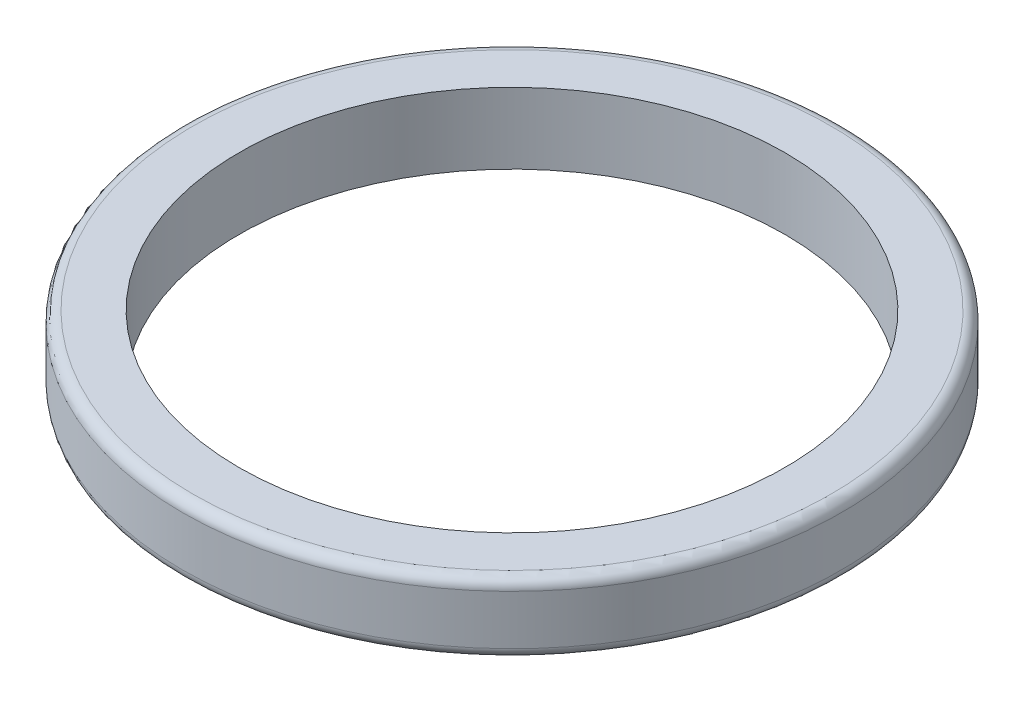
ISO-10303-21;
HEADER;
FILE_DESCRIPTION(('STEP AP214'),'2;1');
FILE_NAME('part.step','',(''),(''),'','','');
FILE_SCHEMA(('AUTOMOTIVE_DESIGN { 1 0 10303 214 1 1 1 1 }'));
ENDSEC;
DATA;
#1=APPLICATION_CONTEXT('core data for automotive mechanical design processes');
#2=APPLICATION_PROTOCOL_DEFINITION('international standard','automotive_design',2000,#1);
#3=PRODUCT_CONTEXT('',#1,'mechanical');
#4=PRODUCT('Part','Part','',(#3));
#5=PRODUCT_RELATED_PRODUCT_CATEGORY('part','',(#4));
#6=PRODUCT_DEFINITION_FORMATION('','',#4);
#7=PRODUCT_DEFINITION_CONTEXT('part definition',#1,'design');
#8=PRODUCT_DEFINITION('design','',#6,#7);
#9=PRODUCT_DEFINITION_SHAPE('','',#8);
#10=(LENGTH_UNIT() NAMED_UNIT(*) SI_UNIT(.MILLI.,.METRE.));
#11=(NAMED_UNIT(*) PLANE_ANGLE_UNIT() SI_UNIT($,.RADIAN.));
#12=(NAMED_UNIT(*) SI_UNIT($,.STERADIAN.) SOLID_ANGLE_UNIT());
#13=UNCERTAINTY_MEASURE_WITH_UNIT(LENGTH_MEASURE(1.E-05),#10,'distance_accuracy_value','');
#14=(GEOMETRIC_REPRESENTATION_CONTEXT(3) GLOBAL_UNCERTAINTY_ASSIGNED_CONTEXT((#13)) GLOBAL_UNIT_ASSIGNED_CONTEXT((#10,
#11,#12)) REPRESENTATION_CONTEXT('',''));
#15=CARTESIAN_POINT('',(0.,0.,0.));
#16=DIRECTION('',(0.,0.,1.));
#17=DIRECTION('',(1.,0.,0.));
#18=AXIS2_PLACEMENT_3D('',#15,#16,#17);
#19=CARTESIAN_POINT('',(0.,3.33333333333333,0.));
#20=DIRECTION('',(0.,1.,0.));
#21=DIRECTION('',(0.,0.,1.));
#22=AXIS2_PLACEMENT_3D('',#19,#20,#21);
#23=PLANE('',#22);
#24=CARTESIAN_POINT('',(0.,3.33333333333333,0.));
#25=DIRECTION('',(0.,1.,0.));
#26=DIRECTION('',(0.,0.,1.));
#27=AXIS2_PLACEMENT_3D('',#24,#25,#26);
#28=CIRCLE('',#27,15.);
#29=CARTESIAN_POINT('',(0.,3.33333333333333,15.));
#30=VERTEX_POINT('',#29);
#31=EDGE_CURVE('E10',#30,#30,#28,.T.);
#32=ORIENTED_EDGE('',*,*,#31,.T.);
#33=EDGE_LOOP('',(#32));
#34=FACE_BOUND('',#33,.T.);
#35=CARTESIAN_POINT('',(0.,3.33333333333333,0.));
#36=DIRECTION('',(0.,1.,0.));
#37=DIRECTION('',(0.,0.,1.));
#38=AXIS2_PLACEMENT_3D('',#35,#36,#37);
#39=CIRCLE('',#38,12.8333333333333);
#40=CARTESIAN_POINT('',(0.,3.33333333333333,12.8333333333333));
#41=VERTEX_POINT('',#40);
#42=EDGE_CURVE('E70',#41,#41,#39,.T.);
#43=ORIENTED_EDGE('',*,*,#42,.F.);
#44=EDGE_LOOP('',(#43));
#45=FACE_BOUND('',#44,.T.);
#46=ADVANCED_FACE('F43',(#34,#45),#23,.T.);
#47=CARTESIAN_POINT('',(0.,0.,0.));
#48=DIRECTION('',(0.,1.,0.));
#49=DIRECTION('',(0.,0.,1.));
#50=AXIS2_PLACEMENT_3D('',#47,#48,#49);
#51=PLANE('',#50);
#52=CARTESIAN_POINT('',(0.,0.,0.));
#53=DIRECTION('',(0.,1.,0.));
#54=DIRECTION('',(0.,0.,1.));
#55=AXIS2_PLACEMENT_3D('',#52,#53,#54);
#56=CIRCLE('',#55,15.);
#57=CARTESIAN_POINT('',(0.,0.,15.));
#58=VERTEX_POINT('',#57);
#59=EDGE_CURVE('E51',#58,#58,#56,.F.);
#60=ORIENTED_EDGE('',*,*,#59,.T.);
#61=EDGE_LOOP('',(#60));
#62=FACE_BOUND('',#61,.T.);
#63=CARTESIAN_POINT('',(0.,0.,0.));
#64=DIRECTION('',(0.,1.,0.));
#65=DIRECTION('',(0.,0.,1.));
#66=AXIS2_PLACEMENT_3D('',#63,#64,#65);
#67=CIRCLE('',#66,12.8333333333333);
#68=CARTESIAN_POINT('',(0.,0.,12.8333333333333));
#69=VERTEX_POINT('',#68);
#70=EDGE_CURVE('E66',#69,#69,#67,.T.);
#71=ORIENTED_EDGE('',*,*,#70,.T.);
#72=EDGE_LOOP('',(#71));
#73=FACE_BOUND('',#72,.T.);
#74=ADVANCED_FACE('F79',(#62,#73),#51,.F.);
#75=CARTESIAN_POINT('',(0.,3.33333333333333,0.));
#76=DIRECTION('',(0.,-1.,0.));
#77=DIRECTION('',(0.,0.,-1.));
#78=AXIS2_PLACEMENT_3D('',#75,#76,#77);
#79=CYLINDRICAL_SURFACE('',#78,15.5);
#80=CARTESIAN_POINT('',(0.,0.5,0.));
#81=DIRECTION('',(0.,1.,0.));
#82=DIRECTION('',(0.,0.,1.));
#83=AXIS2_PLACEMENT_3D('',#80,#81,#82);
#84=CIRCLE('',#83,15.5);
#85=CARTESIAN_POINT('',(0.,0.5,15.5));
#86=VERTEX_POINT('',#85);
#87=EDGE_CURVE('E57',#86,#86,#84,.T.);
#88=ORIENTED_EDGE('',*,*,#87,.T.);
#89=EDGE_LOOP('',(#88));
#90=FACE_BOUND('',#89,.T.);
#91=CARTESIAN_POINT('',(0.,2.83333333333333,0.));
#92=DIRECTION('',(0.,1.,0.));
#93=DIRECTION('',(0.,0.,1.));
#94=AXIS2_PLACEMENT_3D('',#91,#92,#93);
#95=CIRCLE('',#94,15.5);
#96=CARTESIAN_POINT('',(0.,2.83333333333333,15.5));
#97=VERTEX_POINT('',#96);
#98=EDGE_CURVE('E61',#97,#97,#95,.F.);
#99=ORIENTED_EDGE('',*,*,#98,.T.);
#100=EDGE_LOOP('',(#99));
#101=FACE_BOUND('',#100,.T.);
#102=ADVANCED_FACE('F88',(#90,#101),#79,.T.);
#103=CARTESIAN_POINT('',(0.,3.33333333333333,0.));
#104=DIRECTION('',(0.,-1.,0.));
#105=DIRECTION('',(0.,0.,-1.));
#106=AXIS2_PLACEMENT_3D('',#103,#104,#105);
#107=CYLINDRICAL_SURFACE('',#106,12.8333333333333);
#108=ORIENTED_EDGE('',*,*,#42,.T.);
#109=EDGE_LOOP('',(#108));
#110=FACE_BOUND('',#109,.T.);
#111=ORIENTED_EDGE('',*,*,#70,.F.);
#112=EDGE_LOOP('',(#111));
#113=FACE_BOUND('',#112,.T.);
#114=ADVANCED_FACE('F76',(#110,#113),#107,.F.);
#115=CARTESIAN_POINT('',(0.,0.5,0.));
#116=DIRECTION('',(0.,1.,0.));
#117=DIRECTION('',(0.,0.,1.));
#118=AXIS2_PLACEMENT_3D('',#115,#116,#117);
#119=TOROIDAL_SURFACE('',#118,15.,0.5);
#120=ORIENTED_EDGE('',*,*,#59,.F.);
#121=EDGE_LOOP('',(#120));
#122=FACE_BOUND('',#121,.T.);
#123=ORIENTED_EDGE('',*,*,#87,.F.);
#124=EDGE_LOOP('',(#123));
#125=FACE_BOUND('',#124,.T.);
#126=ADVANCED_FACE('F95',(#122,#125),#119,.T.);
#127=CARTESIAN_POINT('',(0.,2.83333333333333,0.));
#128=DIRECTION('',(0.,1.,0.));
#129=DIRECTION('',(0.,0.,1.));
#130=AXIS2_PLACEMENT_3D('',#127,#128,#129);
#131=TOROIDAL_SURFACE('',#130,15.,0.5);
#132=ORIENTED_EDGE('',*,*,#98,.F.);
#133=EDGE_LOOP('',(#132));
#134=FACE_BOUND('',#133,.T.);
#135=ORIENTED_EDGE('',*,*,#31,.F.);
#136=EDGE_LOOP('',(#135));
#137=FACE_BOUND('',#136,.T.);
#138=ADVANCED_FACE('F44',(#134,#137),#131,.T.);
#139=CLOSED_SHELL('',(#46,#74,#102,#114,#126,#138));
#140=MANIFOLD_SOLID_BREP('B2',#139);
#141=ADVANCED_BREP_SHAPE_REPRESENTATION('',(#18,#140),#14);
#142=SHAPE_DEFINITION_REPRESENTATION(#9,#141);
ENDSEC;
END-ISO-10303-21;
